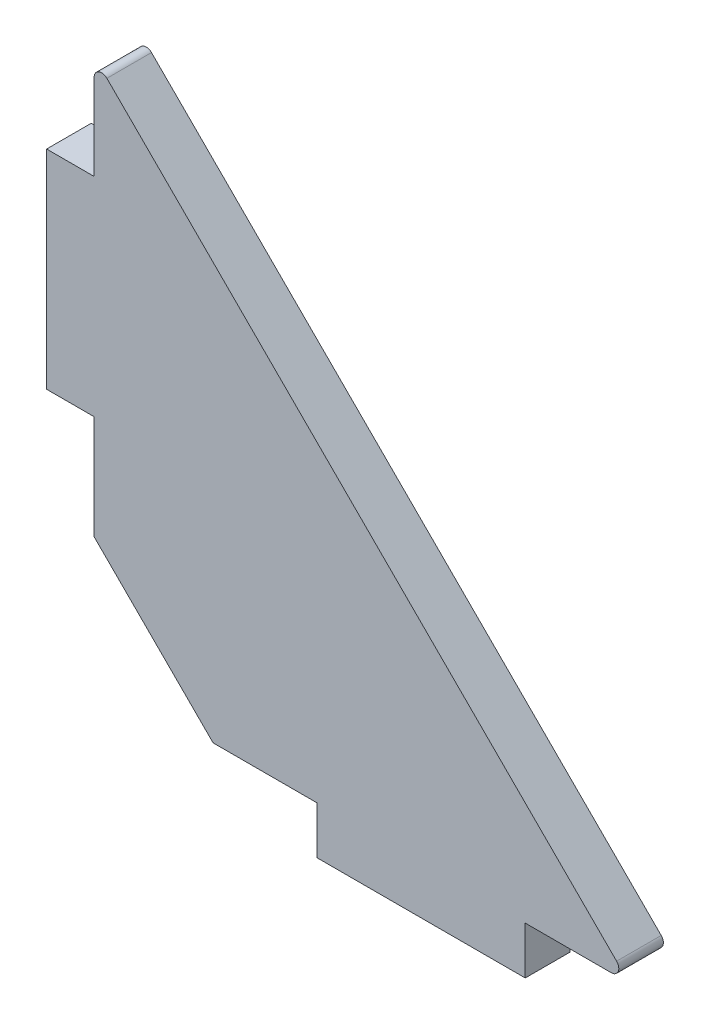
ISO-10303-21;
HEADER;
FILE_DESCRIPTION(('STEP AP214'),'2;1');
FILE_NAME('part.step','',(''),(''),'','','');
FILE_SCHEMA(('AUTOMOTIVE_DESIGN { 1 0 10303 214 1 1 1 1 }'));
ENDSEC;
DATA;
#1=APPLICATION_CONTEXT('core data for automotive mechanical design processes');
#2=APPLICATION_PROTOCOL_DEFINITION('international standard','automotive_design',2000,#1);
#3=PRODUCT_CONTEXT('',#1,'mechanical');
#4=PRODUCT('Part','Part','',(#3));
#5=PRODUCT_RELATED_PRODUCT_CATEGORY('part','',(#4));
#6=PRODUCT_DEFINITION_FORMATION('','',#4);
#7=PRODUCT_DEFINITION_CONTEXT('part definition',#1,'design');
#8=PRODUCT_DEFINITION('design','',#6,#7);
#9=PRODUCT_DEFINITION_SHAPE('','',#8);
#10=(LENGTH_UNIT() NAMED_UNIT(*) SI_UNIT(.MILLI.,.METRE.));
#11=(NAMED_UNIT(*) PLANE_ANGLE_UNIT() SI_UNIT($,.RADIAN.));
#12=(NAMED_UNIT(*) SI_UNIT($,.STERADIAN.) SOLID_ANGLE_UNIT());
#13=UNCERTAINTY_MEASURE_WITH_UNIT(LENGTH_MEASURE(1.E-05),#10,'distance_accuracy_value','');
#14=(GEOMETRIC_REPRESENTATION_CONTEXT(3) GLOBAL_UNCERTAINTY_ASSIGNED_CONTEXT((#13)) GLOBAL_UNIT_ASSIGNED_CONTEXT((#10,
#11,#12)) REPRESENTATION_CONTEXT('',''));
#15=CARTESIAN_POINT('',(0.,0.,0.));
#16=DIRECTION('',(0.,0.,1.));
#17=DIRECTION('',(1.,0.,0.));
#18=AXIS2_PLACEMENT_3D('',#15,#16,#17);
#19=CARTESIAN_POINT('',(34.7928932188135,0.5,-3.));
#20=DIRECTION('',(0.,0.,1.));
#21=DIRECTION('',(1.,0.,0.));
#22=AXIS2_PLACEMENT_3D('',#19,#20,#21);
#23=CYLINDRICAL_SURFACE('',#22,0.5);
#24=DIRECTION('',(0.,0.,1.));
#25=VECTOR('',#24,1.);
#26=CARTESIAN_POINT('',(35.1464466094068,0.85355339059328,-3.));
#27=LINE('',#26,#25);
#28=CARTESIAN_POINT('',(35.1464466094068,0.853553390593279,0.));
#29=VERTEX_POINT('',#28);
#30=CARTESIAN_POINT('',(35.1464466094068,0.853553390593278,-3.));
#31=VERTEX_POINT('',#30);
#32=EDGE_CURVE('E251',#29,#31,#27,.F.);
#33=ORIENTED_EDGE('',*,*,#32,.F.);
#34=CARTESIAN_POINT('',(34.7928932188135,0.5,0.));
#35=DIRECTION('',(0.,0.,1.));
#36=DIRECTION('',(1.,0.,0.));
#37=AXIS2_PLACEMENT_3D('',#34,#35,#36);
#38=CIRCLE('',#37,0.5);
#39=CARTESIAN_POINT('',(34.7928932188135,0.,0.));
#40=VERTEX_POINT('',#39);
#41=EDGE_CURVE('E20',#29,#40,#38,.F.);
#42=ORIENTED_EDGE('',*,*,#41,.T.);
#43=DIRECTION('',(0.,0.,1.));
#44=VECTOR('',#43,1.);
#45=CARTESIAN_POINT('',(34.7928932188135,0.,-3.));
#46=LINE('',#45,#44);
#47=CARTESIAN_POINT('',(34.7928932188135,0.,-3.));
#48=VERTEX_POINT('',#47);
#49=EDGE_CURVE('E127',#48,#40,#46,.T.);
#50=ORIENTED_EDGE('',*,*,#49,.F.);
#51=CARTESIAN_POINT('',(34.7928932188135,0.5,-3.));
#52=DIRECTION('',(0.,0.,1.));
#53=DIRECTION('',(1.,0.,0.));
#54=AXIS2_PLACEMENT_3D('',#51,#52,#53);
#55=CIRCLE('',#54,0.5);
#56=EDGE_CURVE('E252',#48,#31,#55,.T.);
#57=ORIENTED_EDGE('',*,*,#56,.T.);
#58=EDGE_LOOP('',(#33,#42,#50,#57));
#59=FACE_BOUND('',#58,.T.);
#60=ADVANCED_FACE('F17',(#59),#23,.T.);
#61=CARTESIAN_POINT('',(0.5,34.7928932188132,-3.));
#62=DIRECTION('',(0.,0.,1.));
#63=DIRECTION('',(1.,0.,0.));
#64=AXIS2_PLACEMENT_3D('',#61,#62,#63);
#65=CYLINDRICAL_SURFACE('',#64,0.5);
#66=CARTESIAN_POINT('',(0.5,34.7928932188132,0.));
#67=DIRECTION('',(0.,0.,1.));
#68=DIRECTION('',(1.,0.,0.));
#69=AXIS2_PLACEMENT_3D('',#66,#67,#68);
#70=CIRCLE('',#69,0.5);
#71=CARTESIAN_POINT('',(0.,34.7928932188132,0.));
#72=VERTEX_POINT('',#71);
#73=CARTESIAN_POINT('',(0.853553390593265,35.1464466094064,0.));
#74=VERTEX_POINT('',#73);
#75=EDGE_CURVE('E256',#72,#74,#70,.F.);
#76=ORIENTED_EDGE('',*,*,#75,.T.);
#77=DIRECTION('',(0.,0.,1.));
#78=VECTOR('',#77,1.);
#79=CARTESIAN_POINT('',(0.853553390593269,35.1464466094064,-3.));
#80=LINE('',#79,#78);
#81=CARTESIAN_POINT('',(0.853553390593269,35.1464466094064,-3.));
#82=VERTEX_POINT('',#81);
#83=EDGE_CURVE('E250',#82,#74,#80,.T.);
#84=ORIENTED_EDGE('',*,*,#83,.F.);
#85=CARTESIAN_POINT('',(0.5,34.7928932188132,-3.));
#86=DIRECTION('',(0.,0.,1.));
#87=DIRECTION('',(1.,0.,0.));
#88=AXIS2_PLACEMENT_3D('',#85,#86,#87);
#89=CIRCLE('',#88,0.5);
#90=CARTESIAN_POINT('',(0.,34.7928932188132,-3.));
#91=VERTEX_POINT('',#90);
#92=EDGE_CURVE('E255',#82,#91,#89,.T.);
#93=ORIENTED_EDGE('',*,*,#92,.T.);
#94=DIRECTION('',(0.,0.,1.));
#95=VECTOR('',#94,1.);
#96=CARTESIAN_POINT('',(0.,34.7928932188132,-3.));
#97=LINE('',#96,#95);
#98=EDGE_CURVE('E244',#72,#91,#97,.F.);
#99=ORIENTED_EDGE('',*,*,#98,.F.);
#100=EDGE_LOOP('',(#76,#84,#93,#99));
#101=FACE_BOUND('',#100,.T.);
#102=ADVANCED_FACE('F261',(#101),#65,.T.);
#103=CARTESIAN_POINT('',(0.,0.,-3.));
#104=DIRECTION('',(0.,0.,1.));
#105=DIRECTION('',(1.,0.,0.));
#106=AXIS2_PLACEMENT_3D('',#103,#104,#105);
#107=PLANE('',#106);
#108=ORIENTED_EDGE('',*,*,#56,.F.);
#109=DIRECTION('',(1.,0.,0.));
#110=VECTOR('',#109,1.);
#111=CARTESIAN_POINT('',(36.0000000000001,0.,-3.));
#112=LINE('',#111,#110);
#113=CARTESIAN_POINT('',(29.0000000000001,0.,-3.));
#114=VERTEX_POINT('',#113);
#115=EDGE_CURVE('E254',#114,#48,#112,.T.);
#116=ORIENTED_EDGE('',*,*,#115,.F.);
#117=DIRECTION('',(0.,1.,0.));
#118=VECTOR('',#117,1.);
#119=CARTESIAN_POINT('',(29.0000000000001,0.,-3.));
#120=LINE('',#119,#118);
#121=CARTESIAN_POINT('',(29.0000000000001,-3.2,-3.));
#122=VERTEX_POINT('',#121);
#123=EDGE_CURVE('E134',#122,#114,#120,.T.);
#124=ORIENTED_EDGE('',*,*,#123,.F.);
#125=DIRECTION('',(1.,0.,0.));
#126=VECTOR('',#125,1.);
#127=CARTESIAN_POINT('',(15.0000000000001,-3.2,-3.));
#128=LINE('',#127,#126);
#129=CARTESIAN_POINT('',(15.0000000000001,-3.2,-3.));
#130=VERTEX_POINT('',#129);
#131=EDGE_CURVE('E153',#130,#122,#128,.T.);
#132=ORIENTED_EDGE('',*,*,#131,.F.);
#133=DIRECTION('',(0.,-1.,0.));
#134=VECTOR('',#133,1.);
#135=CARTESIAN_POINT('',(15.0000000000001,0.,-3.));
#136=LINE('',#135,#134);
#137=CARTESIAN_POINT('',(15.0000000000001,0.,-3.));
#138=VERTEX_POINT('',#137);
#139=EDGE_CURVE('E154',#138,#130,#136,.T.);
#140=ORIENTED_EDGE('',*,*,#139,.F.);
#141=DIRECTION('',(1.,0.,0.));
#142=VECTOR('',#141,1.);
#143=CARTESIAN_POINT('',(36.0000000000001,0.,-3.));
#144=LINE('',#143,#142);
#145=CARTESIAN_POINT('',(8.00000000000009,0.,-3.));
#146=VERTEX_POINT('',#145);
#147=EDGE_CURVE('E168',#146,#138,#144,.T.);
#148=ORIENTED_EDGE('',*,*,#147,.F.);
#149=DIRECTION('',(0.707106781186552,-0.707106781186544,0.));
#150=VECTOR('',#149,1.);
#151=CARTESIAN_POINT('',(8.00000000000009,0.,-3.));
#152=LINE('',#151,#150);
#153=CARTESIAN_POINT('',(0.,8.,-3.));
#154=VERTEX_POINT('',#153);
#155=EDGE_CURVE('E170',#154,#146,#152,.T.);
#156=ORIENTED_EDGE('',*,*,#155,.F.);
#157=DIRECTION('',(0.,1.,0.));
#158=VECTOR('',#157,1.);
#159=CARTESIAN_POINT('',(0.,8.,-3.));
#160=LINE('',#159,#158);
#161=CARTESIAN_POINT('',(0.,15.0000000000001,-3.));
#162=VERTEX_POINT('',#161);
#163=EDGE_CURVE('E188',#162,#154,#160,.F.);
#164=ORIENTED_EDGE('',*,*,#163,.F.);
#165=DIRECTION('',(1.,0.,0.));
#166=VECTOR('',#165,1.);
#167=CARTESIAN_POINT('',(0.,15.0000000000001,-3.));
#168=LINE('',#167,#166);
#169=CARTESIAN_POINT('',(-3.20000000000005,15.0000000000001,-3.));
#170=VERTEX_POINT('',#169);
#171=EDGE_CURVE('E207',#170,#162,#168,.T.);
#172=ORIENTED_EDGE('',*,*,#171,.F.);
#173=DIRECTION('',(0.,-1.,0.));
#174=VECTOR('',#173,1.);
#175=CARTESIAN_POINT('',(-3.20000000000005,15.0000000000001,-3.));
#176=LINE('',#175,#174);
#177=CARTESIAN_POINT('',(-3.2000000000001,29.0000000000001,-3.));
#178=VERTEX_POINT('',#177);
#179=EDGE_CURVE('E221',#178,#170,#176,.T.);
#180=ORIENTED_EDGE('',*,*,#179,.F.);
#181=DIRECTION('',(-1.,0.,0.));
#182=VECTOR('',#181,1.);
#183=CARTESIAN_POINT('',(-1.04083408558608E-13,29.0000000000001,-3.));
#184=LINE('',#183,#182);
#185=CARTESIAN_POINT('',(0.,29.0000000000001,-3.));
#186=VERTEX_POINT('',#185);
#187=EDGE_CURVE('E235',#186,#178,#184,.T.);
#188=ORIENTED_EDGE('',*,*,#187,.F.);
#189=DIRECTION('',(0.,1.,0.));
#190=VECTOR('',#189,1.);
#191=CARTESIAN_POINT('',(0.,8.,-3.));
#192=LINE('',#191,#190);
#193=EDGE_CURVE('E242',#91,#186,#192,.F.);
#194=ORIENTED_EDGE('',*,*,#193,.F.);
#195=ORIENTED_EDGE('',*,*,#92,.F.);
#196=DIRECTION('',(-0.707106781186551,0.707106781186544,0.));
#197=VECTOR('',#196,1.);
#198=CARTESIAN_POINT('',(0.,35.9999999999997,-3.));
#199=LINE('',#198,#197);
#200=EDGE_CURVE('E247',#31,#82,#199,.T.);
#201=ORIENTED_EDGE('',*,*,#200,.F.);
#202=EDGE_LOOP('',(#108,#116,#124,#132,#140,#148,#156,#164,#172,#180,#188,#194,#195,#201));
#203=FACE_BOUND('',#202,.T.);
#204=ADVANCED_FACE('F306',(#203),#107,.F.);
#205=CARTESIAN_POINT('',(36.0000000000001,0.,-3.));
#206=DIRECTION('',(0.,-1.,0.));
#207=DIRECTION('',(1.,0.,0.));
#208=AXIS2_PLACEMENT_3D('',#205,#206,#207);
#209=PLANE('',#208);
#210=DIRECTION('',(1.,0.,0.));
#211=VECTOR('',#210,1.);
#212=CARTESIAN_POINT('',(0.,0.,0.));
#213=LINE('',#212,#211);
#214=CARTESIAN_POINT('',(29.0000000000001,0.,0.));
#215=VERTEX_POINT('',#214);
#216=EDGE_CURVE('E121',#215,#40,#213,.T.);
#217=ORIENTED_EDGE('',*,*,#216,.F.);
#218=DIRECTION('',(0.,0.,1.));
#219=VECTOR('',#218,1.);
#220=CARTESIAN_POINT('',(29.0000000000001,0.,-3.));
#221=LINE('',#220,#219);
#222=EDGE_CURVE('E125',#114,#215,#221,.T.);
#223=ORIENTED_EDGE('',*,*,#222,.F.);
#224=ORIENTED_EDGE('',*,*,#115,.T.);
#225=ORIENTED_EDGE('',*,*,#49,.T.);
#226=EDGE_LOOP('',(#217,#223,#224,#225));
#227=FACE_BOUND('',#226,.T.);
#228=ADVANCED_FACE('F123',(#227),#209,.T.);
#229=CARTESIAN_POINT('',(0.,35.9999999999997,-3.));
#230=DIRECTION('',(0.707106781186544,0.707106781186551,0.));
#231=DIRECTION('',(-0.707106781186551,0.707106781186544,0.));
#232=AXIS2_PLACEMENT_3D('',#229,#230,#231);
#233=PLANE('',#232);
#234=ORIENTED_EDGE('',*,*,#200,.T.);
#235=ORIENTED_EDGE('',*,*,#83,.T.);
#236=DIRECTION('',(-0.707106781186552,0.707106781186544,0.));
#237=VECTOR('',#236,1.);
#238=CARTESIAN_POINT('',(35.1464466094068,0.85355339059328,0.));
#239=LINE('',#238,#237);
#240=EDGE_CURVE('E128',#29,#74,#239,.T.);
#241=ORIENTED_EDGE('',*,*,#240,.F.);
#242=ORIENTED_EDGE('',*,*,#32,.T.);
#243=EDGE_LOOP('',(#234,#235,#241,#242));
#244=FACE_BOUND('',#243,.T.);
#245=ADVANCED_FACE('F267',(#244),#233,.T.);
#246=CARTESIAN_POINT('',(0.,8.,-3.));
#247=DIRECTION('',(-1.,0.,0.));
#248=DIRECTION('',(0.,0.,1.));
#249=AXIS2_PLACEMENT_3D('',#246,#247,#248);
#250=PLANE('',#249);
#251=ORIENTED_EDGE('',*,*,#193,.T.);
#252=DIRECTION('',(0.,0.,1.));
#253=VECTOR('',#252,1.);
#254=CARTESIAN_POINT('',(0.,29.0000000000001,-3.));
#255=LINE('',#254,#253);
#256=CARTESIAN_POINT('',(0.,29.0000000000001,0.));
#257=VERTEX_POINT('',#256);
#258=EDGE_CURVE('E239',#257,#186,#255,.F.);
#259=ORIENTED_EDGE('',*,*,#258,.F.);
#260=DIRECTION('',(0.,1.,0.));
#261=VECTOR('',#260,1.);
#262=CARTESIAN_POINT('',(0.,0.,0.));
#263=LINE('',#262,#261);
#264=EDGE_CURVE('E271',#72,#257,#263,.F.);
#265=ORIENTED_EDGE('',*,*,#264,.F.);
#266=ORIENTED_EDGE('',*,*,#98,.T.);
#267=EDGE_LOOP('',(#251,#259,#265,#266));
#268=FACE_BOUND('',#267,.T.);
#269=ADVANCED_FACE('F348',(#268),#250,.T.);
#270=CARTESIAN_POINT('',(-1.04083408558608E-13,29.0000000000001,-3.));
#271=DIRECTION('',(0.,1.,0.));
#272=DIRECTION('',(-1.,0.,0.));
#273=AXIS2_PLACEMENT_3D('',#270,#271,#272);
#274=PLANE('',#273);
#275=ORIENTED_EDGE('',*,*,#187,.T.);
#276=DIRECTION('',(0.,0.,1.));
#277=VECTOR('',#276,1.);
#278=CARTESIAN_POINT('',(-3.2000000000001,29.0000000000001,-3.));
#279=LINE('',#278,#277);
#280=CARTESIAN_POINT('',(-3.2000000000001,29.0000000000001,0.));
#281=VERTEX_POINT('',#280);
#282=EDGE_CURVE('E225',#281,#178,#279,.F.);
#283=ORIENTED_EDGE('',*,*,#282,.F.);
#284=DIRECTION('',(1.,0.,0.));
#285=VECTOR('',#284,1.);
#286=CARTESIAN_POINT('',(0.,29.0000000000001,0.));
#287=LINE('',#286,#285);
#288=EDGE_CURVE('E230',#257,#281,#287,.F.);
#289=ORIENTED_EDGE('',*,*,#288,.F.);
#290=ORIENTED_EDGE('',*,*,#258,.T.);
#291=EDGE_LOOP('',(#275,#283,#289,#290));
#292=FACE_BOUND('',#291,.T.);
#293=ADVANCED_FACE('F344',(#292),#274,.T.);
#294=CARTESIAN_POINT('',(-3.20000000000005,15.0000000000001,-3.));
#295=DIRECTION('',(-1.,0.,0.));
#296=DIRECTION('',(0.,-1.,0.));
#297=AXIS2_PLACEMENT_3D('',#294,#295,#296);
#298=PLANE('',#297);
#299=ORIENTED_EDGE('',*,*,#179,.T.);
#300=DIRECTION('',(0.,0.,1.));
#301=VECTOR('',#300,1.);
#302=CARTESIAN_POINT('',(-3.20000000000005,15.0000000000001,-3.));
#303=LINE('',#302,#301);
#304=CARTESIAN_POINT('',(-3.20000000000006,15.0000000000001,0.));
#305=VERTEX_POINT('',#304);
#306=EDGE_CURVE('E211',#305,#170,#303,.F.);
#307=ORIENTED_EDGE('',*,*,#306,.F.);
#308=DIRECTION('',(0.,1.,0.));
#309=VECTOR('',#308,1.);
#310=CARTESIAN_POINT('',(-3.2000000000001,0.,0.));
#311=LINE('',#310,#309);
#312=EDGE_CURVE('E216',#281,#305,#311,.F.);
#313=ORIENTED_EDGE('',*,*,#312,.F.);
#314=ORIENTED_EDGE('',*,*,#282,.T.);
#315=EDGE_LOOP('',(#299,#307,#313,#314));
#316=FACE_BOUND('',#315,.T.);
#317=ADVANCED_FACE('F340',(#316),#298,.T.);
#318=CARTESIAN_POINT('',(0.,15.0000000000001,-3.));
#319=DIRECTION('',(0.,-1.,0.));
#320=DIRECTION('',(1.,0.,0.));
#321=AXIS2_PLACEMENT_3D('',#318,#319,#320);
#322=PLANE('',#321);
#323=ORIENTED_EDGE('',*,*,#171,.T.);
#324=DIRECTION('',(0.,0.,1.));
#325=VECTOR('',#324,1.);
#326=CARTESIAN_POINT('',(0.,15.0000000000001,-3.));
#327=LINE('',#326,#325);
#328=CARTESIAN_POINT('',(0.,15.0000000000001,0.));
#329=VERTEX_POINT('',#328);
#330=EDGE_CURVE('E192',#329,#162,#327,.F.);
#331=ORIENTED_EDGE('',*,*,#330,.F.);
#332=DIRECTION('',(1.,0.,0.));
#333=VECTOR('',#332,1.);
#334=CARTESIAN_POINT('',(0.,15.0000000000001,0.));
#335=LINE('',#334,#333);
#336=EDGE_CURVE('E202',#305,#329,#335,.T.);
#337=ORIENTED_EDGE('',*,*,#336,.F.);
#338=ORIENTED_EDGE('',*,*,#306,.T.);
#339=EDGE_LOOP('',(#323,#331,#337,#338));
#340=FACE_BOUND('',#339,.T.);
#341=ADVANCED_FACE('F336',(#340),#322,.T.);
#342=CARTESIAN_POINT('',(0.,8.,-3.));
#343=DIRECTION('',(-1.,0.,0.));
#344=DIRECTION('',(0.,0.,1.));
#345=AXIS2_PLACEMENT_3D('',#342,#343,#344);
#346=PLANE('',#345);
#347=DIRECTION('',(0.,0.,1.));
#348=VECTOR('',#347,1.);
#349=CARTESIAN_POINT('',(0.,8.,-3.));
#350=LINE('',#349,#348);
#351=CARTESIAN_POINT('',(0.,8.,0.));
#352=VERTEX_POINT('',#351);
#353=EDGE_CURVE('E179',#352,#154,#350,.F.);
#354=ORIENTED_EDGE('',*,*,#353,.F.);
#355=DIRECTION('',(0.,1.,0.));
#356=VECTOR('',#355,1.);
#357=CARTESIAN_POINT('',(0.,0.,0.));
#358=LINE('',#357,#356);
#359=EDGE_CURVE('E197',#329,#352,#358,.F.);
#360=ORIENTED_EDGE('',*,*,#359,.F.);
#361=ORIENTED_EDGE('',*,*,#330,.T.);
#362=ORIENTED_EDGE('',*,*,#163,.T.);
#363=EDGE_LOOP('',(#354,#360,#361,#362));
#364=FACE_BOUND('',#363,.T.);
#365=ADVANCED_FACE('F332',(#364),#346,.T.);
#366=CARTESIAN_POINT('',(8.00000000000009,0.,-3.));
#367=DIRECTION('',(-0.707106781186544,-0.707106781186552,0.));
#368=DIRECTION('',(0.707106781186552,-0.707106781186544,0.));
#369=AXIS2_PLACEMENT_3D('',#366,#367,#368);
#370=PLANE('',#369);
#371=ORIENTED_EDGE('',*,*,#155,.T.);
#372=DIRECTION('',(0.,0.,1.));
#373=VECTOR('',#372,1.);
#374=CARTESIAN_POINT('',(8.00000000000009,0.,-3.));
#375=LINE('',#374,#373);
#376=CARTESIAN_POINT('',(8.00000000000009,0.,0.));
#377=VERTEX_POINT('',#376);
#378=EDGE_CURVE('E165',#377,#146,#375,.F.);
#379=ORIENTED_EDGE('',*,*,#378,.F.);
#380=DIRECTION('',(0.707106781186552,-0.707106781186543,0.));
#381=VECTOR('',#380,1.);
#382=CARTESIAN_POINT('',(0.,8.,0.));
#383=LINE('',#382,#381);
#384=EDGE_CURVE('E174',#352,#377,#383,.T.);
#385=ORIENTED_EDGE('',*,*,#384,.F.);
#386=ORIENTED_EDGE('',*,*,#353,.T.);
#387=EDGE_LOOP('',(#371,#379,#385,#386));
#388=FACE_BOUND('',#387,.T.);
#389=ADVANCED_FACE('F328',(#388),#370,.T.);
#390=CARTESIAN_POINT('',(36.0000000000001,0.,-3.));
#391=DIRECTION('',(0.,-1.,0.));
#392=DIRECTION('',(1.,0.,0.));
#393=AXIS2_PLACEMENT_3D('',#390,#391,#392);
#394=PLANE('',#393);
#395=DIRECTION('',(1.,0.,0.));
#396=VECTOR('',#395,1.);
#397=CARTESIAN_POINT('',(0.,0.,0.));
#398=LINE('',#397,#396);
#399=CARTESIAN_POINT('',(15.0000000000001,0.,0.));
#400=VERTEX_POINT('',#399);
#401=EDGE_CURVE('E143',#377,#400,#398,.T.);
#402=ORIENTED_EDGE('',*,*,#401,.F.);
#403=ORIENTED_EDGE('',*,*,#378,.T.);
#404=ORIENTED_EDGE('',*,*,#147,.T.);
#405=DIRECTION('',(0.,0.,1.));
#406=VECTOR('',#405,1.);
#407=CARTESIAN_POINT('',(15.0000000000001,0.,-3.));
#408=LINE('',#407,#406);
#409=EDGE_CURVE('E158',#400,#138,#408,.F.);
#410=ORIENTED_EDGE('',*,*,#409,.F.);
#411=EDGE_LOOP('',(#402,#403,#404,#410));
#412=FACE_BOUND('',#411,.T.);
#413=ADVANCED_FACE('F324',(#412),#394,.T.);
#414=CARTESIAN_POINT('',(15.0000000000001,0.,-3.));
#415=DIRECTION('',(-1.,0.,0.));
#416=DIRECTION('',(0.,-1.,0.));
#417=AXIS2_PLACEMENT_3D('',#414,#415,#416);
#418=PLANE('',#417);
#419=ORIENTED_EDGE('',*,*,#139,.T.);
#420=DIRECTION('',(0.,0.,1.));
#421=VECTOR('',#420,1.);
#422=CARTESIAN_POINT('',(15.0000000000001,-3.2,-3.));
#423=LINE('',#422,#421);
#424=CARTESIAN_POINT('',(15.0000000000001,-3.2,0.));
#425=VERTEX_POINT('',#424);
#426=EDGE_CURVE('E151',#425,#130,#423,.F.);
#427=ORIENTED_EDGE('',*,*,#426,.F.);
#428=DIRECTION('',(0.,1.,0.));
#429=VECTOR('',#428,1.);
#430=CARTESIAN_POINT('',(15.0000000000001,0.,0.));
#431=LINE('',#430,#429);
#432=EDGE_CURVE('E140',#400,#425,#431,.F.);
#433=ORIENTED_EDGE('',*,*,#432,.F.);
#434=ORIENTED_EDGE('',*,*,#409,.T.);
#435=EDGE_LOOP('',(#419,#427,#433,#434));
#436=FACE_BOUND('',#435,.T.);
#437=ADVANCED_FACE('F321',(#436),#418,.T.);
#438=CARTESIAN_POINT('',(15.0000000000001,-3.2,-3.));
#439=DIRECTION('',(0.,-1.,0.));
#440=DIRECTION('',(1.,0.,0.));
#441=AXIS2_PLACEMENT_3D('',#438,#439,#440);
#442=PLANE('',#441);
#443=ORIENTED_EDGE('',*,*,#131,.T.);
#444=DIRECTION('',(0.,0.,1.));
#445=VECTOR('',#444,1.);
#446=CARTESIAN_POINT('',(29.0000000000001,-3.2,-3.));
#447=LINE('',#446,#445);
#448=CARTESIAN_POINT('',(29.0000000000001,-3.2,0.));
#449=VERTEX_POINT('',#448);
#450=EDGE_CURVE('E35',#449,#122,#447,.F.);
#451=ORIENTED_EDGE('',*,*,#450,.F.);
#452=DIRECTION('',(1.,0.,0.));
#453=VECTOR('',#452,1.);
#454=CARTESIAN_POINT('',(0.,-3.2,0.));
#455=LINE('',#454,#453);
#456=EDGE_CURVE('E26',#425,#449,#455,.T.);
#457=ORIENTED_EDGE('',*,*,#456,.F.);
#458=ORIENTED_EDGE('',*,*,#426,.T.);
#459=EDGE_LOOP('',(#443,#451,#457,#458));
#460=FACE_BOUND('',#459,.T.);
#461=ADVANCED_FACE('F303',(#460),#442,.T.);
#462=CARTESIAN_POINT('',(29.0000000000001,0.,-3.));
#463=DIRECTION('',(1.,0.,0.));
#464=DIRECTION('',(0.,1.,0.));
#465=AXIS2_PLACEMENT_3D('',#462,#463,#464);
#466=PLANE('',#465);
#467=ORIENTED_EDGE('',*,*,#123,.T.);
#468=ORIENTED_EDGE('',*,*,#222,.T.);
#469=DIRECTION('',(0.,1.,0.));
#470=VECTOR('',#469,1.);
#471=CARTESIAN_POINT('',(29.0000000000001,0.,0.));
#472=LINE('',#471,#470);
#473=EDGE_CURVE('E11',#449,#215,#472,.T.);
#474=ORIENTED_EDGE('',*,*,#473,.F.);
#475=ORIENTED_EDGE('',*,*,#450,.T.);
#476=EDGE_LOOP('',(#467,#468,#474,#475));
#477=FACE_BOUND('',#476,.T.);
#478=ADVANCED_FACE('F131',(#477),#466,.T.);
#479=CARTESIAN_POINT('',(0.,0.,0.));
#480=DIRECTION('',(0.,0.,1.));
#481=DIRECTION('',(1.,0.,0.));
#482=AXIS2_PLACEMENT_3D('',#479,#480,#481);
#483=PLANE('',#482);
#484=ORIENTED_EDGE('',*,*,#456,.T.);
#485=ORIENTED_EDGE('',*,*,#473,.T.);
#486=ORIENTED_EDGE('',*,*,#216,.T.);
#487=ORIENTED_EDGE('',*,*,#41,.F.);
#488=ORIENTED_EDGE('',*,*,#240,.T.);
#489=ORIENTED_EDGE('',*,*,#75,.F.);
#490=ORIENTED_EDGE('',*,*,#264,.T.);
#491=ORIENTED_EDGE('',*,*,#288,.T.);
#492=ORIENTED_EDGE('',*,*,#312,.T.);
#493=ORIENTED_EDGE('',*,*,#336,.T.);
#494=ORIENTED_EDGE('',*,*,#359,.T.);
#495=ORIENTED_EDGE('',*,*,#384,.T.);
#496=ORIENTED_EDGE('',*,*,#401,.T.);
#497=ORIENTED_EDGE('',*,*,#432,.T.);
#498=EDGE_LOOP('',(#484,#485,#486,#487,#488,#489,#490,#491,#492,#493,#494,#495,#496,#497));
#499=FACE_BOUND('',#498,.T.);
#500=ADVANCED_FACE('F136',(#499),#483,.T.);
#501=CLOSED_SHELL('',(#60,#102,#204,#228,#245,#269,#293,#317,#341,#365,#389,#413,#437,#461,#478,#500));
#502=MANIFOLD_SOLID_BREP('B1',#501);
#503=ADVANCED_BREP_SHAPE_REPRESENTATION('',(#18,#502),#14);
#504=SHAPE_DEFINITION_REPRESENTATION(#9,#503);
ENDSEC;
END-ISO-10303-21;
